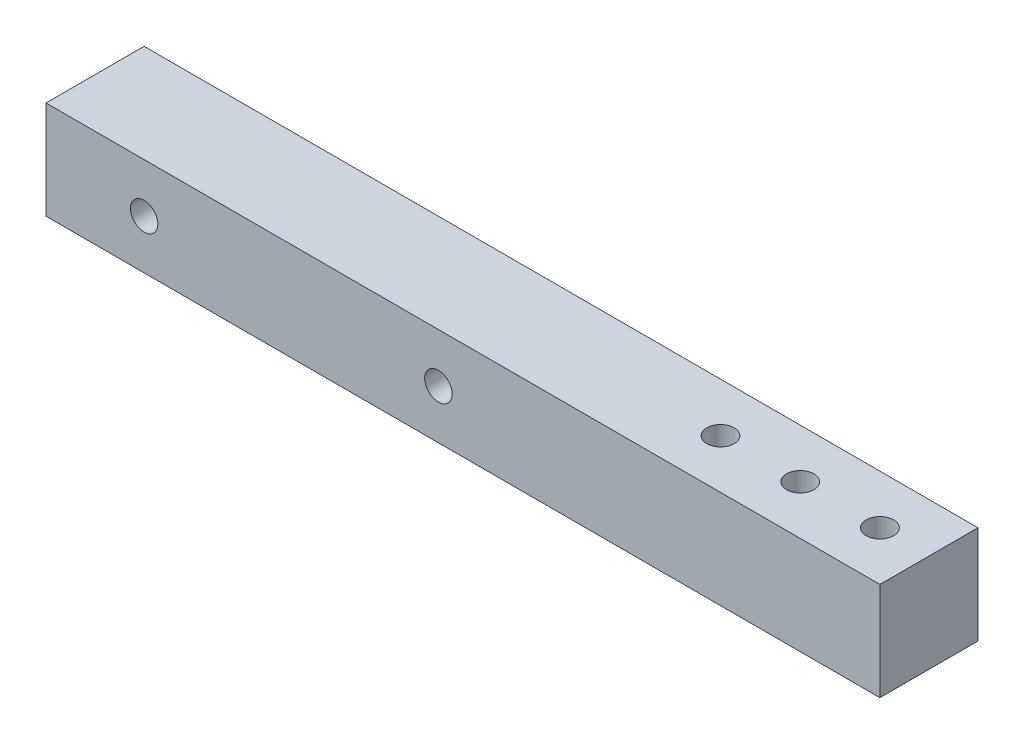
ISO-10303-21;
HEADER;
FILE_DESCRIPTION(('STEP AP214'),'2;1');
FILE_NAME('part.step','',(''),(''),'','','');
FILE_SCHEMA(('AUTOMOTIVE_DESIGN { 1 0 10303 214 1 1 1 1 }'));
ENDSEC;
DATA;
#1=APPLICATION_CONTEXT('core data for automotive mechanical design processes');
#2=APPLICATION_PROTOCOL_DEFINITION('international standard','automotive_design',2000,#1);
#3=PRODUCT_CONTEXT('',#1,'mechanical');
#4=PRODUCT('Part','Part','',(#3));
#5=PRODUCT_RELATED_PRODUCT_CATEGORY('part','',(#4));
#6=PRODUCT_DEFINITION_FORMATION('','',#4);
#7=PRODUCT_DEFINITION_CONTEXT('part definition',#1,'design');
#8=PRODUCT_DEFINITION('design','',#6,#7);
#9=PRODUCT_DEFINITION_SHAPE('','',#8);
#10=(LENGTH_UNIT() NAMED_UNIT(*) SI_UNIT(.MILLI.,.METRE.));
#11=(NAMED_UNIT(*) PLANE_ANGLE_UNIT() SI_UNIT($,.RADIAN.));
#12=(NAMED_UNIT(*) SI_UNIT($,.STERADIAN.) SOLID_ANGLE_UNIT());
#13=UNCERTAINTY_MEASURE_WITH_UNIT(LENGTH_MEASURE(1.E-05),#10,'distance_accuracy_value','');
#14=(GEOMETRIC_REPRESENTATION_CONTEXT(3) GLOBAL_UNCERTAINTY_ASSIGNED_CONTEXT((#13)) GLOBAL_UNIT_ASSIGNED_CONTEXT((#10,
#11,#12)) REPRESENTATION_CONTEXT('',''));
#15=CARTESIAN_POINT('',(0.,0.,0.));
#16=DIRECTION('',(0.,0.,1.));
#17=DIRECTION('',(1.,0.,0.));
#18=AXIS2_PLACEMENT_3D('',#15,#16,#17);
#19=CARTESIAN_POINT('',(0.,0.,12.7));
#20=DIRECTION('',(1.,0.,0.));
#21=DIRECTION('',(0.,0.,-1.));
#22=AXIS2_PLACEMENT_3D('',#19,#20,#21);
#23=PLANE('',#22);
#24=DIRECTION('',(0.,-1.,0.));
#25=VECTOR('',#24,1.);
#26=CARTESIAN_POINT('',(0.,0.,0.));
#27=LINE('',#26,#25);
#28=CARTESIAN_POINT('',(0.,12.7,0.));
#29=VERTEX_POINT('',#28);
#30=CARTESIAN_POINT('',(0.,0.,0.));
#31=VERTEX_POINT('',#30);
#32=EDGE_CURVE('E96',#29,#31,#27,.T.);
#33=ORIENTED_EDGE('',*,*,#32,.T.);
#34=DIRECTION('',(0.,0.,-1.));
#35=VECTOR('',#34,1.);
#36=CARTESIAN_POINT('',(0.,0.,12.7));
#37=LINE('',#36,#35);
#38=CARTESIAN_POINT('',(0.,0.,12.7));
#39=VERTEX_POINT('',#38);
#40=EDGE_CURVE('E11',#39,#31,#37,.T.);
#41=ORIENTED_EDGE('',*,*,#40,.F.);
#42=DIRECTION('',(0.,-1.,0.));
#43=VECTOR('',#42,1.);
#44=CARTESIAN_POINT('',(0.,0.,12.7));
#45=LINE('',#44,#43);
#46=CARTESIAN_POINT('',(0.,12.7,12.7));
#47=VERTEX_POINT('',#46);
#48=EDGE_CURVE('E84',#47,#39,#45,.T.);
#49=ORIENTED_EDGE('',*,*,#48,.F.);
#50=DIRECTION('',(0.,0.,-1.));
#51=VECTOR('',#50,1.);
#52=CARTESIAN_POINT('',(0.,12.7,12.7));
#53=LINE('',#52,#51);
#54=EDGE_CURVE('E92',#47,#29,#53,.T.);
#55=ORIENTED_EDGE('',*,*,#54,.T.);
#56=EDGE_LOOP('',(#33,#41,#49,#55));
#57=FACE_BOUND('',#56,.T.);
#58=ADVANCED_FACE('F33',(#57),#23,.F.);
#59=CARTESIAN_POINT('',(0.,0.,12.7));
#60=DIRECTION('',(0.,1.,0.));
#61=DIRECTION('',(0.,0.,1.));
#62=AXIS2_PLACEMENT_3D('',#59,#60,#61);
#63=PLANE('',#62);
#64=CARTESIAN_POINT('',(91.28125,0.,6.35));
#65=DIRECTION('',(0.,-1.,0.));
#66=DIRECTION('',(0.,0.,-1.));
#67=AXIS2_PLACEMENT_3D('',#64,#65,#66);
#68=CIRCLE('',#67,1.77800000000001);
#69=CARTESIAN_POINT('',(91.28125,0.,4.57199999999999));
#70=VERTEX_POINT('',#69);
#71=EDGE_CURVE('E124',#70,#70,#68,.T.);
#72=ORIENTED_EDGE('',*,*,#71,.F.);
#73=EDGE_LOOP('',(#72));
#74=FACE_BOUND('',#73,.T.);
#75=CARTESIAN_POINT('',(80.9625,0.,6.35));
#76=DIRECTION('',(0.,1.,0.));
#77=DIRECTION('',(0.,0.,1.));
#78=AXIS2_PLACEMENT_3D('',#75,#76,#77);
#79=CIRCLE('',#78,1.77800000000001);
#80=CARTESIAN_POINT('',(80.9625,0.,8.12800000000001));
#81=VERTEX_POINT('',#80);
#82=EDGE_CURVE('E99',#81,#81,#79,.F.);
#83=ORIENTED_EDGE('',*,*,#82,.F.);
#84=EDGE_LOOP('',(#83));
#85=FACE_BOUND('',#84,.T.);
#86=CARTESIAN_POINT('',(101.6,0.,6.35));
#87=DIRECTION('',(0.,1.,0.));
#88=DIRECTION('',(0.,0.,1.));
#89=AXIS2_PLACEMENT_3D('',#86,#87,#88);
#90=CIRCLE('',#89,1.77800000000001);
#91=CARTESIAN_POINT('',(101.6,0.,8.12800000000001));
#92=VERTEX_POINT('',#91);
#93=EDGE_CURVE('E114',#92,#92,#90,.F.);
#94=ORIENTED_EDGE('',*,*,#93,.F.);
#95=EDGE_LOOP('',(#94));
#96=FACE_BOUND('',#95,.T.);
#97=DIRECTION('',(1.,0.,0.));
#98=VECTOR('',#97,1.);
#99=CARTESIAN_POINT('',(0.,0.,0.));
#100=LINE('',#99,#98);
#101=CARTESIAN_POINT('',(107.95,0.,0.));
#102=VERTEX_POINT('',#101);
#103=EDGE_CURVE('E88',#31,#102,#100,.T.);
#104=ORIENTED_EDGE('',*,*,#103,.T.);
#105=DIRECTION('',(0.,0.,-1.));
#106=VECTOR('',#105,1.);
#107=CARTESIAN_POINT('',(107.95,0.,12.7));
#108=LINE('',#107,#106);
#109=CARTESIAN_POINT('',(107.95,0.,12.7));
#110=VERTEX_POINT('',#109);
#111=EDGE_CURVE('E41',#110,#102,#108,.T.);
#112=ORIENTED_EDGE('',*,*,#111,.F.);
#113=DIRECTION('',(1.,0.,0.));
#114=VECTOR('',#113,1.);
#115=CARTESIAN_POINT('',(0.,0.,12.7));
#116=LINE('',#115,#114);
#117=EDGE_CURVE('E79',#39,#110,#116,.T.);
#118=ORIENTED_EDGE('',*,*,#117,.F.);
#119=ORIENTED_EDGE('',*,*,#40,.T.);
#120=EDGE_LOOP('',(#104,#112,#118,#119));
#121=FACE_BOUND('',#120,.T.);
#122=ADVANCED_FACE('F87',(#74,#85,#96,#121),#63,.F.);
#123=CARTESIAN_POINT('',(107.95,0.,12.7));
#124=DIRECTION('',(-1.,0.,0.));
#125=DIRECTION('',(0.,0.,1.));
#126=AXIS2_PLACEMENT_3D('',#123,#124,#125);
#127=PLANE('',#126);
#128=DIRECTION('',(0.,1.,0.));
#129=VECTOR('',#128,1.);
#130=CARTESIAN_POINT('',(107.95,0.,0.));
#131=LINE('',#130,#129);
#132=CARTESIAN_POINT('',(107.95,12.7,0.));
#133=VERTEX_POINT('',#132);
#134=EDGE_CURVE('E66',#102,#133,#131,.T.);
#135=ORIENTED_EDGE('',*,*,#134,.T.);
#136=DIRECTION('',(0.,0.,-1.));
#137=VECTOR('',#136,1.);
#138=CARTESIAN_POINT('',(107.95,12.7,12.7));
#139=LINE('',#138,#137);
#140=CARTESIAN_POINT('',(107.95,12.7,12.7));
#141=VERTEX_POINT('',#140);
#142=EDGE_CURVE('E89',#141,#133,#139,.T.);
#143=ORIENTED_EDGE('',*,*,#142,.F.);
#144=DIRECTION('',(0.,1.,0.));
#145=VECTOR('',#144,1.);
#146=CARTESIAN_POINT('',(107.95,0.,12.7));
#147=LINE('',#146,#145);
#148=EDGE_CURVE('E82',#110,#141,#147,.T.);
#149=ORIENTED_EDGE('',*,*,#148,.F.);
#150=ORIENTED_EDGE('',*,*,#111,.T.);
#151=EDGE_LOOP('',(#135,#143,#149,#150));
#152=FACE_BOUND('',#151,.T.);
#153=ADVANCED_FACE('F90',(#152),#127,.F.);
#154=CARTESIAN_POINT('',(0.,12.7,12.7));
#155=DIRECTION('',(0.,-1.,0.));
#156=DIRECTION('',(0.,0.,-1.));
#157=AXIS2_PLACEMENT_3D('',#154,#155,#156);
#158=PLANE('',#157);
#159=CARTESIAN_POINT('',(91.28125,12.7,6.35));
#160=DIRECTION('',(0.,-1.,0.));
#161=DIRECTION('',(0.,0.,-1.));
#162=AXIS2_PLACEMENT_3D('',#159,#160,#161);
#163=CIRCLE('',#162,1.77800000000001);
#164=CARTESIAN_POINT('',(91.28125,12.7,4.57199999999999));
#165=VERTEX_POINT('',#164);
#166=EDGE_CURVE('E117',#165,#165,#163,.F.);
#167=ORIENTED_EDGE('',*,*,#166,.F.);
#168=EDGE_LOOP('',(#167));
#169=FACE_BOUND('',#168,.T.);
#170=CARTESIAN_POINT('',(80.9625,12.7,6.35));
#171=DIRECTION('',(0.,1.,0.));
#172=DIRECTION('',(0.,0.,1.));
#173=AXIS2_PLACEMENT_3D('',#170,#171,#172);
#174=CIRCLE('',#173,1.77800000000001);
#175=CARTESIAN_POINT('',(80.9625,12.7,8.12800000000001));
#176=VERTEX_POINT('',#175);
#177=EDGE_CURVE('E113',#176,#176,#174,.T.);
#178=ORIENTED_EDGE('',*,*,#177,.F.);
#179=EDGE_LOOP('',(#178));
#180=FACE_BOUND('',#179,.T.);
#181=CARTESIAN_POINT('',(101.6,12.7,6.35));
#182=DIRECTION('',(0.,1.,0.));
#183=DIRECTION('',(0.,0.,1.));
#184=AXIS2_PLACEMENT_3D('',#181,#182,#183);
#185=CIRCLE('',#184,1.77800000000001);
#186=CARTESIAN_POINT('',(101.6,12.7,8.12800000000001));
#187=VERTEX_POINT('',#186);
#188=EDGE_CURVE('E110',#187,#187,#185,.T.);
#189=ORIENTED_EDGE('',*,*,#188,.F.);
#190=EDGE_LOOP('',(#189));
#191=FACE_BOUND('',#190,.T.);
#192=DIRECTION('',(-1.,0.,0.));
#193=VECTOR('',#192,1.);
#194=CARTESIAN_POINT('',(0.,12.7,0.));
#195=LINE('',#194,#193);
#196=EDGE_CURVE('E72',#133,#29,#195,.T.);
#197=ORIENTED_EDGE('',*,*,#196,.T.);
#198=ORIENTED_EDGE('',*,*,#54,.F.);
#199=DIRECTION('',(-1.,0.,0.));
#200=VECTOR('',#199,1.);
#201=CARTESIAN_POINT('',(0.,12.7,12.7));
#202=LINE('',#201,#200);
#203=EDGE_CURVE('E49',#141,#47,#202,.T.);
#204=ORIENTED_EDGE('',*,*,#203,.F.);
#205=ORIENTED_EDGE('',*,*,#142,.T.);
#206=EDGE_LOOP('',(#197,#198,#204,#205));
#207=FACE_BOUND('',#206,.T.);
#208=ADVANCED_FACE('F104',(#169,#180,#191,#207),#158,.F.);
#209=CARTESIAN_POINT('',(0.,0.,12.7));
#210=DIRECTION('',(0.,0.,-1.));
#211=DIRECTION('',(-1.,0.,0.));
#212=AXIS2_PLACEMENT_3D('',#209,#210,#211);
#213=PLANE('',#212);
#214=CARTESIAN_POINT('',(12.7,6.35,12.7));
#215=DIRECTION('',(0.,0.,-1.));
#216=DIRECTION('',(-1.,0.,0.));
#217=AXIS2_PLACEMENT_3D('',#214,#215,#216);
#218=CIRCLE('',#217,1.778);
#219=CARTESIAN_POINT('',(10.922,6.35,12.7));
#220=VERTEX_POINT('',#219);
#221=EDGE_CURVE('E127',#220,#220,#218,.F.);
#222=ORIENTED_EDGE('',*,*,#221,.F.);
#223=EDGE_LOOP('',(#222));
#224=FACE_BOUND('',#223,.T.);
#225=CARTESIAN_POINT('',(50.8,6.35,12.7));
#226=DIRECTION('',(0.,0.,-1.));
#227=DIRECTION('',(-1.,0.,0.));
#228=AXIS2_PLACEMENT_3D('',#225,#226,#227);
#229=CIRCLE('',#228,1.778);
#230=CARTESIAN_POINT('',(49.022,6.35,12.7));
#231=VERTEX_POINT('',#230);
#232=EDGE_CURVE('E132',#231,#231,#229,.F.);
#233=ORIENTED_EDGE('',*,*,#232,.F.);
#234=EDGE_LOOP('',(#233));
#235=FACE_BOUND('',#234,.T.);
#236=ORIENTED_EDGE('',*,*,#48,.T.);
#237=ORIENTED_EDGE('',*,*,#117,.T.);
#238=ORIENTED_EDGE('',*,*,#148,.T.);
#239=ORIENTED_EDGE('',*,*,#203,.T.);
#240=EDGE_LOOP('',(#236,#237,#238,#239));
#241=FACE_BOUND('',#240,.T.);
#242=ADVANCED_FACE('F80',(#224,#235,#241),#213,.F.);
#243=CARTESIAN_POINT('',(0.,0.,0.));
#244=DIRECTION('',(0.,0.,-1.));
#245=DIRECTION('',(-1.,0.,0.));
#246=AXIS2_PLACEMENT_3D('',#243,#244,#245);
#247=PLANE('',#246);
#248=CARTESIAN_POINT('',(12.7,6.35,0.));
#249=DIRECTION('',(0.,0.,-1.));
#250=DIRECTION('',(-1.,0.,0.));
#251=AXIS2_PLACEMENT_3D('',#248,#249,#250);
#252=CIRCLE('',#251,1.778);
#253=CARTESIAN_POINT('',(10.922,6.35,0.));
#254=VERTEX_POINT('',#253);
#255=EDGE_CURVE('E131',#254,#254,#252,.T.);
#256=ORIENTED_EDGE('',*,*,#255,.F.);
#257=EDGE_LOOP('',(#256));
#258=FACE_BOUND('',#257,.T.);
#259=CARTESIAN_POINT('',(50.8,6.35,0.));
#260=DIRECTION('',(0.,0.,-1.));
#261=DIRECTION('',(-1.,0.,0.));
#262=AXIS2_PLACEMENT_3D('',#259,#260,#261);
#263=CIRCLE('',#262,1.778);
#264=CARTESIAN_POINT('',(49.022,6.35,0.));
#265=VERTEX_POINT('',#264);
#266=EDGE_CURVE('E128',#265,#265,#263,.T.);
#267=ORIENTED_EDGE('',*,*,#266,.F.);
#268=EDGE_LOOP('',(#267));
#269=FACE_BOUND('',#268,.T.);
#270=ORIENTED_EDGE('',*,*,#32,.F.);
#271=ORIENTED_EDGE('',*,*,#196,.F.);
#272=ORIENTED_EDGE('',*,*,#134,.F.);
#273=ORIENTED_EDGE('',*,*,#103,.F.);
#274=EDGE_LOOP('',(#270,#271,#272,#273));
#275=FACE_BOUND('',#274,.T.);
#276=ADVANCED_FACE('F107',(#258,#269,#275),#247,.T.);
#277=CARTESIAN_POINT('',(101.6,-5.02894342779874,6.35));
#278=DIRECTION('',(0.,1.,0.));
#279=DIRECTION('',(0.,0.,1.));
#280=AXIS2_PLACEMENT_3D('',#277,#278,#279);
#281=CYLINDRICAL_SURFACE('',#280,1.77800000000001);
#282=ORIENTED_EDGE('',*,*,#93,.T.);
#283=EDGE_LOOP('',(#282));
#284=FACE_BOUND('',#283,.T.);
#285=ORIENTED_EDGE('',*,*,#188,.T.);
#286=EDGE_LOOP('',(#285));
#287=FACE_BOUND('',#286,.T.);
#288=ADVANCED_FACE('F144',(#284,#287),#281,.F.);
#289=CARTESIAN_POINT('',(80.9625,-5.02894342779874,6.35));
#290=DIRECTION('',(0.,1.,0.));
#291=DIRECTION('',(0.,0.,1.));
#292=AXIS2_PLACEMENT_3D('',#289,#290,#291);
#293=CYLINDRICAL_SURFACE('',#292,1.77800000000001);
#294=ORIENTED_EDGE('',*,*,#82,.T.);
#295=EDGE_LOOP('',(#294));
#296=FACE_BOUND('',#295,.T.);
#297=ORIENTED_EDGE('',*,*,#177,.T.);
#298=EDGE_LOOP('',(#297));
#299=FACE_BOUND('',#298,.T.);
#300=ADVANCED_FACE('F159',(#296,#299),#293,.F.);
#301=CARTESIAN_POINT('',(91.28125,17.7289434277987,6.35));
#302=DIRECTION('',(0.,-1.,0.));
#303=DIRECTION('',(0.,0.,-1.));
#304=AXIS2_PLACEMENT_3D('',#301,#302,#303);
#305=CYLINDRICAL_SURFACE('',#304,1.77800000000001);
#306=ORIENTED_EDGE('',*,*,#166,.T.);
#307=EDGE_LOOP('',(#306));
#308=FACE_BOUND('',#307,.T.);
#309=ORIENTED_EDGE('',*,*,#71,.T.);
#310=EDGE_LOOP('',(#309));
#311=FACE_BOUND('',#310,.T.);
#312=ADVANCED_FACE('F150',(#308,#311),#305,.F.);
#313=CARTESIAN_POINT('',(50.8,6.35,17.7289434277987));
#314=DIRECTION('',(0.,0.,-1.));
#315=DIRECTION('',(-1.,0.,0.));
#316=AXIS2_PLACEMENT_3D('',#313,#314,#315);
#317=CYLINDRICAL_SURFACE('',#316,1.778);
#318=ORIENTED_EDGE('',*,*,#232,.T.);
#319=EDGE_LOOP('',(#318));
#320=FACE_BOUND('',#319,.T.);
#321=ORIENTED_EDGE('',*,*,#266,.T.);
#322=EDGE_LOOP('',(#321));
#323=FACE_BOUND('',#322,.T.);
#324=ADVANCED_FACE('F148',(#320,#323),#317,.F.);
#325=CARTESIAN_POINT('',(12.7,6.35,17.7289434277987));
#326=DIRECTION('',(0.,0.,-1.));
#327=DIRECTION('',(-1.,0.,0.));
#328=AXIS2_PLACEMENT_3D('',#325,#326,#327);
#329=CYLINDRICAL_SURFACE('',#328,1.778);
#330=ORIENTED_EDGE('',*,*,#221,.T.);
#331=EDGE_LOOP('',(#330));
#332=FACE_BOUND('',#331,.T.);
#333=ORIENTED_EDGE('',*,*,#255,.T.);
#334=EDGE_LOOP('',(#333));
#335=FACE_BOUND('',#334,.T.);
#336=ADVANCED_FACE('F140',(#332,#335),#329,.F.);
#337=CLOSED_SHELL('',(#58,#122,#153,#208,#242,#276,#288,#300,#312,#324,#336));
#338=MANIFOLD_SOLID_BREP('B2',#337);
#339=ADVANCED_BREP_SHAPE_REPRESENTATION('',(#18,#338),#14);
#340=SHAPE_DEFINITION_REPRESENTATION(#9,#339);
ENDSEC;
END-ISO-10303-21;
